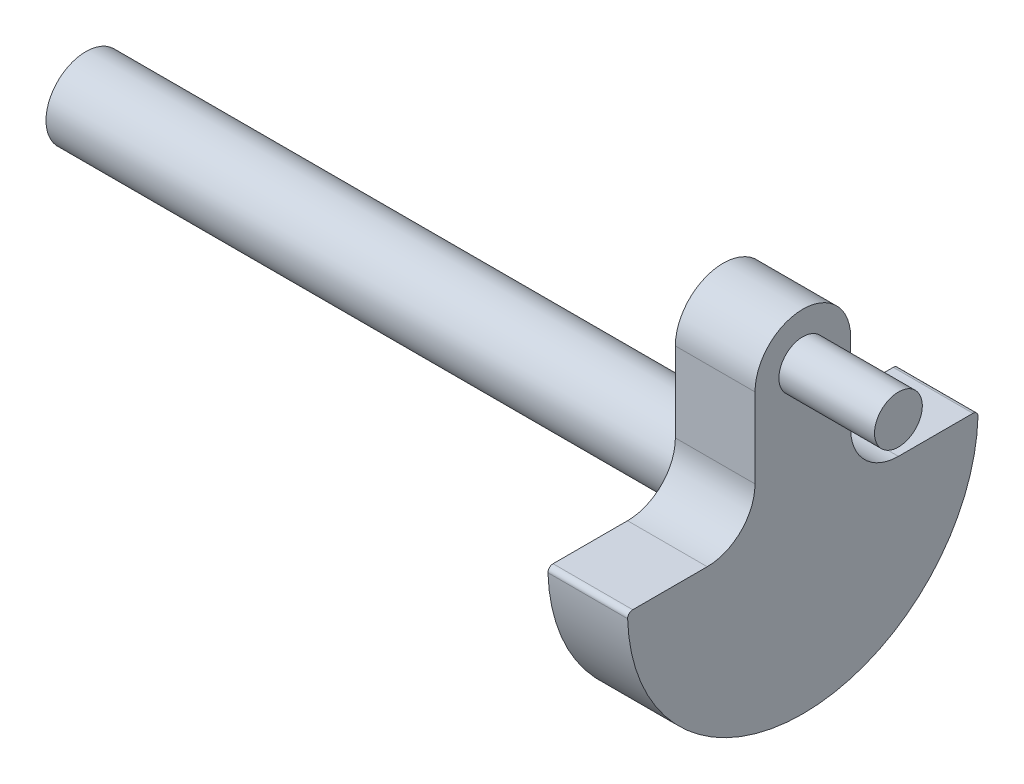
ISO-10303-21;
HEADER;
FILE_DESCRIPTION(('STEP AP214'),'2;1');
FILE_NAME('part.step','',(''),(''),'','','');
FILE_SCHEMA(('AUTOMOTIVE_DESIGN { 1 0 10303 214 1 1 1 1 }'));
ENDSEC;
DATA;
#1=APPLICATION_CONTEXT('core data for automotive mechanical design processes');
#2=APPLICATION_PROTOCOL_DEFINITION('international standard','automotive_design',2000,#1);
#3=PRODUCT_CONTEXT('',#1,'mechanical');
#4=PRODUCT('Part','Part','',(#3));
#5=PRODUCT_RELATED_PRODUCT_CATEGORY('part','',(#4));
#6=PRODUCT_DEFINITION_FORMATION('','',#4);
#7=PRODUCT_DEFINITION_CONTEXT('part definition',#1,'design');
#8=PRODUCT_DEFINITION('design','',#6,#7);
#9=PRODUCT_DEFINITION_SHAPE('','',#8);
#10=(LENGTH_UNIT() NAMED_UNIT(*) SI_UNIT(.MILLI.,.METRE.));
#11=(NAMED_UNIT(*) PLANE_ANGLE_UNIT() SI_UNIT($,.RADIAN.));
#12=(NAMED_UNIT(*) SI_UNIT($,.STERADIAN.) SOLID_ANGLE_UNIT());
#13=UNCERTAINTY_MEASURE_WITH_UNIT(LENGTH_MEASURE(1.E-05),#10,'distance_accuracy_value','');
#14=(GEOMETRIC_REPRESENTATION_CONTEXT(3) GLOBAL_UNCERTAINTY_ASSIGNED_CONTEXT((#13)) GLOBAL_UNIT_ASSIGNED_CONTEXT((#10,
#11,#12)) REPRESENTATION_CONTEXT('',''));
#15=CARTESIAN_POINT('',(0.,0.,0.));
#16=DIRECTION('',(0.,0.,1.));
#17=DIRECTION('',(1.,0.,0.));
#18=AXIS2_PLACEMENT_3D('',#15,#16,#17);
#19=CARTESIAN_POINT('',(3.96875,6.35,0.));
#20=DIRECTION('',(1.,0.,0.));
#21=DIRECTION('',(0.,0.,-1.));
#22=AXIS2_PLACEMENT_3D('',#19,#20,#21);
#23=PLANE('',#22);
#24=CARTESIAN_POINT('',(3.96875,6.35,0.));
#25=DIRECTION('',(1.,0.,0.));
#26=DIRECTION('',(0.,0.,-1.));
#27=AXIS2_PLACEMENT_3D('',#24,#25,#26);
#28=CIRCLE('',#27,1.190625);
#29=CARTESIAN_POINT('',(3.96875,6.35,-1.190625));
#30=VERTEX_POINT('',#29);
#31=EDGE_CURVE('E242',#30,#30,#28,.T.);
#32=ORIENTED_EDGE('',*,*,#31,.F.);
#33=EDGE_LOOP('',(#32));
#34=FACE_BOUND('',#33,.T.);
#35=CARTESIAN_POINT('',(3.96875,0.,0.));
#36=DIRECTION('',(1.,0.,0.));
#37=DIRECTION('',(0.,0.,-1.));
#38=AXIS2_PLACEMENT_3D('',#35,#36,#37);
#39=CIRCLE('',#38,8.73125);
#40=CARTESIAN_POINT('',(3.96875,-0.261610486891387,8.7273298617417));
#41=VERTEX_POINT('',#40);
#42=CARTESIAN_POINT('',(3.96875,-0.261610486891387,-8.7273298617417));
#43=VERTEX_POINT('',#42);
#44=EDGE_CURVE('E209',#41,#43,#39,.T.);
#45=ORIENTED_EDGE('',*,*,#44,.T.);
#46=CARTESIAN_POINT('',(3.96875,-0.254000000000001,-8.4734439021274));
#47=DIRECTION('',(1.,0.,0.));
#48=DIRECTION('',(0.,0.,-1.));
#49=AXIS2_PLACEMENT_3D('',#46,#47,#48);
#50=CIRCLE('',#49,0.254);
#51=CARTESIAN_POINT('',(3.96875,0.,-8.4734439021274));
#52=VERTEX_POINT('',#51);
#53=EDGE_CURVE('E51',#43,#52,#50,.T.);
#54=ORIENTED_EDGE('',*,*,#53,.T.);
#55=DIRECTION('',(0.,0.,1.));
#56=VECTOR('',#55,1.);
#57=CARTESIAN_POINT('',(3.96875,0.,-8.73125));
#58=LINE('',#57,#56);
#59=CARTESIAN_POINT('',(3.96875,0.,-4.76250000000001));
#60=VERTEX_POINT('',#59);
#61=EDGE_CURVE('E208',#52,#60,#58,.T.);
#62=ORIENTED_EDGE('',*,*,#61,.T.);
#63=CARTESIAN_POINT('',(3.96875,2.38125,-4.76250000000001));
#64=DIRECTION('',(1.,0.,0.));
#65=DIRECTION('',(0.,0.,-1.));
#66=AXIS2_PLACEMENT_3D('',#63,#64,#65);
#67=CIRCLE('',#66,2.38125);
#68=CARTESIAN_POINT('',(3.96875,2.38124999999999,-2.38125000000001));
#69=VERTEX_POINT('',#68);
#70=EDGE_CURVE('E178',#60,#69,#67,.F.);
#71=ORIENTED_EDGE('',*,*,#70,.T.);
#72=DIRECTION('',(0.,1.,0.));
#73=VECTOR('',#72,1.);
#74=CARTESIAN_POINT('',(3.96875,6.35,-2.38125));
#75=LINE('',#74,#73);
#76=CARTESIAN_POINT('',(3.96875,6.35,-2.38125));
#77=VERTEX_POINT('',#76);
#78=EDGE_CURVE('E139',#69,#77,#75,.T.);
#79=ORIENTED_EDGE('',*,*,#78,.T.);
#80=CARTESIAN_POINT('',(3.96875,6.35,0.));
#81=DIRECTION('',(1.,0.,0.));
#82=DIRECTION('',(0.,0.,-1.));
#83=AXIS2_PLACEMENT_3D('',#80,#81,#82);
#84=CIRCLE('',#83,2.38125);
#85=CARTESIAN_POINT('',(3.96875,6.35,2.38125));
#86=VERTEX_POINT('',#85);
#87=EDGE_CURVE('E135',#77,#86,#84,.T.);
#88=ORIENTED_EDGE('',*,*,#87,.T.);
#89=DIRECTION('',(0.,-1.,0.));
#90=VECTOR('',#89,1.);
#91=CARTESIAN_POINT('',(3.96875,6.35,2.38125));
#92=LINE('',#91,#90);
#93=CARTESIAN_POINT('',(3.96875,2.38125000000001,2.38124999999999));
#94=VERTEX_POINT('',#93);
#95=EDGE_CURVE('E122',#86,#94,#92,.T.);
#96=ORIENTED_EDGE('',*,*,#95,.T.);
#97=CARTESIAN_POINT('',(3.96875,2.38125,4.76249999999999));
#98=DIRECTION('',(1.,0.,0.));
#99=DIRECTION('',(0.,0.,-1.));
#100=AXIS2_PLACEMENT_3D('',#97,#98,#99);
#101=CIRCLE('',#100,2.38125);
#102=CARTESIAN_POINT('',(3.96875,0.,4.76249999999999));
#103=VERTEX_POINT('',#102);
#104=EDGE_CURVE('E184',#94,#103,#101,.F.);
#105=ORIENTED_EDGE('',*,*,#104,.T.);
#106=DIRECTION('',(0.,0.,1.));
#107=VECTOR('',#106,1.);
#108=CARTESIAN_POINT('',(3.96875,0.,2.38124999999998));
#109=LINE('',#108,#107);
#110=CARTESIAN_POINT('',(3.96875,0.,8.4734439021274));
#111=VERTEX_POINT('',#110);
#112=EDGE_CURVE('E134',#103,#111,#109,.T.);
#113=ORIENTED_EDGE('',*,*,#112,.T.);
#114=CARTESIAN_POINT('',(3.96875,-0.254000000000001,8.4734439021274));
#115=DIRECTION('',(1.,0.,0.));
#116=DIRECTION('',(0.,0.,-1.));
#117=AXIS2_PLACEMENT_3D('',#114,#115,#116);
#118=CIRCLE('',#117,0.254);
#119=EDGE_CURVE('E203',#111,#41,#118,.T.);
#120=ORIENTED_EDGE('',*,*,#119,.T.);
#121=EDGE_LOOP('',(#45,#54,#62,#71,#79,#88,#96,#105,#113,#120));
#122=FACE_BOUND('',#121,.T.);
#123=ADVANCED_FACE('F42',(#34,#122),#23,.T.);
#124=CARTESIAN_POINT('',(0.,6.35,0.));
#125=DIRECTION('',(1.,0.,0.));
#126=DIRECTION('',(0.,0.,-1.));
#127=AXIS2_PLACEMENT_3D('',#124,#125,#126);
#128=PLANE('',#127);
#129=CARTESIAN_POINT('',(0.,0.,0.));
#130=DIRECTION('',(-1.,0.,0.));
#131=DIRECTION('',(0.,0.,1.));
#132=AXIS2_PLACEMENT_3D('',#129,#130,#131);
#133=CIRCLE('',#132,1.984375);
#134=CARTESIAN_POINT('',(0.,0.,1.984375));
#135=VERTEX_POINT('',#134);
#136=EDGE_CURVE('E150',#135,#135,#133,.T.);
#137=ORIENTED_EDGE('',*,*,#136,.F.);
#138=EDGE_LOOP('',(#137));
#139=FACE_BOUND('',#138,.T.);
#140=DIRECTION('',(0.,0.,1.));
#141=VECTOR('',#140,1.);
#142=CARTESIAN_POINT('',(0.,0.,-8.73125));
#143=LINE('',#142,#141);
#144=CARTESIAN_POINT('',(0.,0.,-8.4734439021274));
#145=VERTEX_POINT('',#144);
#146=CARTESIAN_POINT('',(0.,0.,-4.76250000000001));
#147=VERTEX_POINT('',#146);
#148=EDGE_CURVE('E224',#145,#147,#143,.T.);
#149=ORIENTED_EDGE('',*,*,#148,.F.);
#150=CARTESIAN_POINT('',(0.,-0.254000000000001,-8.4734439021274));
#151=DIRECTION('',(1.,0.,0.));
#152=DIRECTION('',(0.,0.,-1.));
#153=AXIS2_PLACEMENT_3D('',#150,#151,#152);
#154=CIRCLE('',#153,0.254);
#155=CARTESIAN_POINT('',(0.,-0.261610486891387,-8.7273298617417));
#156=VERTEX_POINT('',#155);
#157=EDGE_CURVE('E194',#145,#156,#154,.F.);
#158=ORIENTED_EDGE('',*,*,#157,.T.);
#159=CARTESIAN_POINT('',(0.,0.,0.));
#160=DIRECTION('',(1.,0.,0.));
#161=DIRECTION('',(0.,0.,-1.));
#162=AXIS2_PLACEMENT_3D('',#159,#160,#161);
#163=CIRCLE('',#162,8.73125);
#164=CARTESIAN_POINT('',(0.,-0.261610486891387,8.7273298617417));
#165=VERTEX_POINT('',#164);
#166=EDGE_CURVE('E223',#165,#156,#163,.T.);
#167=ORIENTED_EDGE('',*,*,#166,.F.);
#168=CARTESIAN_POINT('',(0.,-0.254000000000001,8.4734439021274));
#169=DIRECTION('',(1.,0.,0.));
#170=DIRECTION('',(0.,0.,-1.));
#171=AXIS2_PLACEMENT_3D('',#168,#169,#170);
#172=CIRCLE('',#171,0.254);
#173=CARTESIAN_POINT('',(0.,0.,8.4734439021274));
#174=VERTEX_POINT('',#173);
#175=EDGE_CURVE('E191',#165,#174,#172,.F.);
#176=ORIENTED_EDGE('',*,*,#175,.T.);
#177=DIRECTION('',(0.,0.,1.));
#178=VECTOR('',#177,1.);
#179=CARTESIAN_POINT('',(0.,0.,2.38124999999998));
#180=LINE('',#179,#178);
#181=CARTESIAN_POINT('',(0.,0.,4.76249999999999));
#182=VERTEX_POINT('',#181);
#183=EDGE_CURVE('E228',#182,#174,#180,.T.);
#184=ORIENTED_EDGE('',*,*,#183,.F.);
#185=CARTESIAN_POINT('',(0.,2.38125,4.76249999999999));
#186=DIRECTION('',(1.,0.,0.));
#187=DIRECTION('',(0.,0.,-1.));
#188=AXIS2_PLACEMENT_3D('',#185,#186,#187);
#189=CIRCLE('',#188,2.38125);
#190=CARTESIAN_POINT('',(0.,2.38125000000001,2.38124999999999));
#191=VERTEX_POINT('',#190);
#192=EDGE_CURVE('E181',#182,#191,#189,.T.);
#193=ORIENTED_EDGE('',*,*,#192,.T.);
#194=DIRECTION('',(0.,-1.,0.));
#195=VECTOR('',#194,1.);
#196=CARTESIAN_POINT('',(0.,6.35,2.38125));
#197=LINE('',#196,#195);
#198=CARTESIAN_POINT('',(0.,6.35,2.38125));
#199=VERTEX_POINT('',#198);
#200=EDGE_CURVE('E233',#199,#191,#197,.T.);
#201=ORIENTED_EDGE('',*,*,#200,.F.);
#202=CARTESIAN_POINT('',(0.,6.35,0.));
#203=DIRECTION('',(1.,0.,0.));
#204=DIRECTION('',(0.,0.,-1.));
#205=AXIS2_PLACEMENT_3D('',#202,#203,#204);
#206=CIRCLE('',#205,2.38125);
#207=CARTESIAN_POINT('',(0.,6.35,-2.38125));
#208=VERTEX_POINT('',#207);
#209=EDGE_CURVE('E148',#208,#199,#206,.T.);
#210=ORIENTED_EDGE('',*,*,#209,.F.);
#211=DIRECTION('',(0.,1.,0.));
#212=VECTOR('',#211,1.);
#213=CARTESIAN_POINT('',(0.,6.35,-2.38125));
#214=LINE('',#213,#212);
#215=CARTESIAN_POINT('',(0.,2.38124999999999,-2.38125000000001));
#216=VERTEX_POINT('',#215);
#217=EDGE_CURVE('E144',#216,#208,#214,.T.);
#218=ORIENTED_EDGE('',*,*,#217,.F.);
#219=CARTESIAN_POINT('',(0.,2.38125,-4.76250000000001));
#220=DIRECTION('',(1.,0.,0.));
#221=DIRECTION('',(0.,0.,-1.));
#222=AXIS2_PLACEMENT_3D('',#219,#220,#221);
#223=CIRCLE('',#222,2.38125);
#224=EDGE_CURVE('E174',#216,#147,#223,.T.);
#225=ORIENTED_EDGE('',*,*,#224,.T.);
#226=EDGE_LOOP('',(#149,#158,#167,#176,#184,#193,#201,#210,#218,#225));
#227=FACE_BOUND('',#226,.T.);
#228=ADVANCED_FACE('F222',(#139,#227),#128,.F.);
#229=CARTESIAN_POINT('',(3.96875,6.35,0.));
#230=DIRECTION('',(-1.,0.,0.));
#231=DIRECTION('',(0.,0.,1.));
#232=AXIS2_PLACEMENT_3D('',#229,#230,#231);
#233=CYLINDRICAL_SURFACE('',#232,2.38125);
#234=ORIENTED_EDGE('',*,*,#209,.T.);
#235=DIRECTION('',(-1.,0.,0.));
#236=VECTOR('',#235,1.);
#237=CARTESIAN_POINT('',(3.96875,6.35,2.38125));
#238=LINE('',#237,#236);
#239=EDGE_CURVE('E127',#86,#199,#238,.T.);
#240=ORIENTED_EDGE('',*,*,#239,.F.);
#241=ORIENTED_EDGE('',*,*,#87,.F.);
#242=DIRECTION('',(-1.,0.,0.));
#243=VECTOR('',#242,1.);
#244=CARTESIAN_POINT('',(3.96875,6.35,-2.38125));
#245=LINE('',#244,#243);
#246=EDGE_CURVE('E151',#77,#208,#245,.T.);
#247=ORIENTED_EDGE('',*,*,#246,.T.);
#248=EDGE_LOOP('',(#234,#240,#241,#247));
#249=FACE_BOUND('',#248,.T.);
#250=ADVANCED_FACE('F146',(#249),#233,.T.);
#251=CARTESIAN_POINT('',(3.96875,6.35,2.38125));
#252=DIRECTION('',(0.,0.,-1.));
#253=DIRECTION('',(0.,1.,0.));
#254=AXIS2_PLACEMENT_3D('',#251,#252,#253);
#255=PLANE('',#254);
#256=ORIENTED_EDGE('',*,*,#200,.T.);
#257=DIRECTION('',(-1.,0.,0.));
#258=VECTOR('',#257,1.);
#259=CARTESIAN_POINT('',(3.96875,2.38125000000001,2.38124999999999));
#260=LINE('',#259,#258);
#261=EDGE_CURVE('E130',#191,#94,#260,.F.);
#262=ORIENTED_EDGE('',*,*,#261,.T.);
#263=ORIENTED_EDGE('',*,*,#95,.F.);
#264=ORIENTED_EDGE('',*,*,#239,.T.);
#265=EDGE_LOOP('',(#256,#262,#263,#264));
#266=FACE_BOUND('',#265,.T.);
#267=ADVANCED_FACE('F125',(#266),#255,.F.);
#268=CARTESIAN_POINT('',(3.96875,0.,2.38124999999998));
#269=DIRECTION('',(0.,-1.,0.));
#270=DIRECTION('',(0.,0.,-1.));
#271=AXIS2_PLACEMENT_3D('',#268,#269,#270);
#272=PLANE('',#271);
#273=ORIENTED_EDGE('',*,*,#183,.T.);
#274=DIRECTION('',(-1.,0.,0.));
#275=VECTOR('',#274,1.);
#276=CARTESIAN_POINT('',(3.96875,0.,8.4734439021274));
#277=LINE('',#276,#275);
#278=EDGE_CURVE('E11',#174,#111,#277,.F.);
#279=ORIENTED_EDGE('',*,*,#278,.T.);
#280=ORIENTED_EDGE('',*,*,#112,.F.);
#281=DIRECTION('',(-1.,0.,0.));
#282=VECTOR('',#281,1.);
#283=CARTESIAN_POINT('',(0.,0.,4.76249999999999));
#284=LINE('',#283,#282);
#285=EDGE_CURVE('E168',#103,#182,#284,.T.);
#286=ORIENTED_EDGE('',*,*,#285,.T.);
#287=EDGE_LOOP('',(#273,#279,#280,#286));
#288=FACE_BOUND('',#287,.T.);
#289=ADVANCED_FACE('F291',(#288),#272,.F.);
#290=CARTESIAN_POINT('',(3.96875,0.,0.));
#291=DIRECTION('',(-1.,0.,0.));
#292=DIRECTION('',(0.,0.,1.));
#293=AXIS2_PLACEMENT_3D('',#290,#291,#292);
#294=CYLINDRICAL_SURFACE('',#293,8.73125);
#295=ORIENTED_EDGE('',*,*,#166,.T.);
#296=DIRECTION('',(-1.,0.,0.));
#297=VECTOR('',#296,1.);
#298=CARTESIAN_POINT('',(3.96875,-0.261610486891387,-8.7273298617417));
#299=LINE('',#298,#297);
#300=EDGE_CURVE('E64',#156,#43,#299,.F.);
#301=ORIENTED_EDGE('',*,*,#300,.T.);
#302=ORIENTED_EDGE('',*,*,#44,.F.);
#303=DIRECTION('',(-1.,0.,0.));
#304=VECTOR('',#303,1.);
#305=CARTESIAN_POINT('',(3.96875,-0.261610486891387,8.7273298617417));
#306=LINE('',#305,#304);
#307=EDGE_CURVE('E197',#41,#165,#306,.T.);
#308=ORIENTED_EDGE('',*,*,#307,.T.);
#309=EDGE_LOOP('',(#295,#301,#302,#308));
#310=FACE_BOUND('',#309,.T.);
#311=ADVANCED_FACE('F225',(#310),#294,.T.);
#312=CARTESIAN_POINT('',(3.96875,0.,-8.73125));
#313=DIRECTION('',(0.,-1.,0.));
#314=DIRECTION('',(0.,0.,-1.));
#315=AXIS2_PLACEMENT_3D('',#312,#313,#314);
#316=PLANE('',#315);
#317=ORIENTED_EDGE('',*,*,#61,.F.);
#318=DIRECTION('',(-1.,0.,0.));
#319=VECTOR('',#318,1.);
#320=CARTESIAN_POINT('',(3.96875,0.,-8.4734439021274));
#321=LINE('',#320,#319);
#322=EDGE_CURVE('E187',#52,#145,#321,.T.);
#323=ORIENTED_EDGE('',*,*,#322,.T.);
#324=ORIENTED_EDGE('',*,*,#148,.T.);
#325=DIRECTION('',(-1.,0.,0.));
#326=VECTOR('',#325,1.);
#327=CARTESIAN_POINT('',(3.96875,0.,-4.76250000000001));
#328=LINE('',#327,#326);
#329=EDGE_CURVE('E164',#147,#60,#328,.F.);
#330=ORIENTED_EDGE('',*,*,#329,.T.);
#331=EDGE_LOOP('',(#317,#323,#324,#330));
#332=FACE_BOUND('',#331,.T.);
#333=ADVANCED_FACE('F213',(#332),#316,.F.);
#334=CARTESIAN_POINT('',(3.96875,6.35,-2.38125));
#335=DIRECTION('',(0.,0.,1.));
#336=DIRECTION('',(0.,-1.,0.));
#337=AXIS2_PLACEMENT_3D('',#334,#335,#336);
#338=PLANE('',#337);
#339=ORIENTED_EDGE('',*,*,#78,.F.);
#340=DIRECTION('',(-1.,0.,0.));
#341=VECTOR('',#340,1.);
#342=CARTESIAN_POINT('',(0.,2.38124999999999,-2.38125000000001));
#343=LINE('',#342,#341);
#344=EDGE_CURVE('E156',#69,#216,#343,.T.);
#345=ORIENTED_EDGE('',*,*,#344,.T.);
#346=ORIENTED_EDGE('',*,*,#217,.T.);
#347=ORIENTED_EDGE('',*,*,#246,.F.);
#348=EDGE_LOOP('',(#339,#345,#346,#347));
#349=FACE_BOUND('',#348,.T.);
#350=ADVANCED_FACE('F239',(#349),#338,.F.);
#351=CARTESIAN_POINT('',(8.73125,6.35,0.));
#352=DIRECTION('',(-1.,0.,0.));
#353=DIRECTION('',(0.,0.,1.));
#354=AXIS2_PLACEMENT_3D('',#351,#352,#353);
#355=CYLINDRICAL_SURFACE('',#354,1.190625);
#356=ORIENTED_EDGE('',*,*,#31,.T.);
#357=EDGE_LOOP('',(#356));
#358=FACE_BOUND('',#357,.T.);
#359=CARTESIAN_POINT('',(8.73125,6.35,0.));
#360=DIRECTION('',(-1.,0.,0.));
#361=DIRECTION('',(0.,0.,1.));
#362=AXIS2_PLACEMENT_3D('',#359,#360,#361);
#363=CIRCLE('',#362,1.190625);
#364=CARTESIAN_POINT('',(8.73125,6.35,1.190625));
#365=VERTEX_POINT('',#364);
#366=EDGE_CURVE('E247',#365,#365,#363,.T.);
#367=ORIENTED_EDGE('',*,*,#366,.T.);
#368=EDGE_LOOP('',(#367));
#369=FACE_BOUND('',#368,.T.);
#370=ADVANCED_FACE('F286',(#358,#369),#355,.T.);
#371=CARTESIAN_POINT('',(8.73125,6.35,0.));
#372=DIRECTION('',(-1.,0.,0.));
#373=DIRECTION('',(0.,0.,1.));
#374=AXIS2_PLACEMENT_3D('',#371,#372,#373);
#375=PLANE('',#374);
#376=ORIENTED_EDGE('',*,*,#366,.F.);
#377=EDGE_LOOP('',(#376));
#378=FACE_BOUND('',#377,.T.);
#379=ADVANCED_FACE('F269',(#378),#375,.F.);
#380=CARTESIAN_POINT('',(-31.75,0.,0.));
#381=DIRECTION('',(1.,0.,0.));
#382=DIRECTION('',(0.,0.,-1.));
#383=AXIS2_PLACEMENT_3D('',#380,#381,#382);
#384=CYLINDRICAL_SURFACE('',#383,1.984375);
#385=CARTESIAN_POINT('',(-31.75,0.,0.));
#386=DIRECTION('',(-1.,0.,0.));
#387=DIRECTION('',(0.,0.,1.));
#388=AXIS2_PLACEMENT_3D('',#385,#386,#387);
#389=CIRCLE('',#388,1.984375);
#390=CARTESIAN_POINT('',(-31.75,0.,1.984375));
#391=VERTEX_POINT('',#390);
#392=EDGE_CURVE('E258',#391,#391,#389,.T.);
#393=ORIENTED_EDGE('',*,*,#392,.F.);
#394=EDGE_LOOP('',(#393));
#395=FACE_BOUND('',#394,.T.);
#396=ORIENTED_EDGE('',*,*,#136,.T.);
#397=EDGE_LOOP('',(#396));
#398=FACE_BOUND('',#397,.T.);
#399=ADVANCED_FACE('F266',(#395,#398),#384,.T.);
#400=CARTESIAN_POINT('',(-31.75,0.,0.));
#401=DIRECTION('',(-1.,0.,0.));
#402=DIRECTION('',(0.,0.,1.));
#403=AXIS2_PLACEMENT_3D('',#400,#401,#402);
#404=PLANE('',#403);
#405=ORIENTED_EDGE('',*,*,#392,.T.);
#406=EDGE_LOOP('',(#405));
#407=FACE_BOUND('',#406,.T.);
#408=ADVANCED_FACE('F264',(#407),#404,.T.);
#409=CARTESIAN_POINT('',(3.96875,2.38125,-4.76250000000001));
#410=DIRECTION('',(1.,0.,0.));
#411=DIRECTION('',(0.,0.,-1.));
#412=AXIS2_PLACEMENT_3D('',#409,#410,#411);
#413=CYLINDRICAL_SURFACE('',#412,2.38125);
#414=ORIENTED_EDGE('',*,*,#70,.F.);
#415=ORIENTED_EDGE('',*,*,#329,.F.);
#416=ORIENTED_EDGE('',*,*,#224,.F.);
#417=ORIENTED_EDGE('',*,*,#344,.F.);
#418=EDGE_LOOP('',(#414,#415,#416,#417));
#419=FACE_BOUND('',#418,.T.);
#420=ADVANCED_FACE('F296',(#419),#413,.F.);
#421=CARTESIAN_POINT('',(3.96875,2.38125,4.76249999999999));
#422=DIRECTION('',(1.,0.,0.));
#423=DIRECTION('',(0.,0.,-1.));
#424=AXIS2_PLACEMENT_3D('',#421,#422,#423);
#425=CYLINDRICAL_SURFACE('',#424,2.38125);
#426=ORIENTED_EDGE('',*,*,#104,.F.);
#427=ORIENTED_EDGE('',*,*,#261,.F.);
#428=ORIENTED_EDGE('',*,*,#192,.F.);
#429=ORIENTED_EDGE('',*,*,#285,.F.);
#430=EDGE_LOOP('',(#426,#427,#428,#429));
#431=FACE_BOUND('',#430,.T.);
#432=ADVANCED_FACE('F299',(#431),#425,.F.);
#433=CARTESIAN_POINT('',(3.96875,-0.254000000000001,-8.4734439021274));
#434=DIRECTION('',(-1.,0.,0.));
#435=DIRECTION('',(0.,0.,1.));
#436=AXIS2_PLACEMENT_3D('',#433,#434,#435);
#437=CYLINDRICAL_SURFACE('',#436,0.254);
#438=ORIENTED_EDGE('',*,*,#53,.F.);
#439=ORIENTED_EDGE('',*,*,#300,.F.);
#440=ORIENTED_EDGE('',*,*,#157,.F.);
#441=ORIENTED_EDGE('',*,*,#322,.F.);
#442=EDGE_LOOP('',(#438,#439,#440,#441));
#443=FACE_BOUND('',#442,.T.);
#444=ADVANCED_FACE('F219',(#443),#437,.T.);
#445=CARTESIAN_POINT('',(3.96875,-0.254000000000001,8.4734439021274));
#446=DIRECTION('',(-1.,0.,0.));
#447=DIRECTION('',(0.,0.,1.));
#448=AXIS2_PLACEMENT_3D('',#445,#446,#447);
#449=CYLINDRICAL_SURFACE('',#448,0.254);
#450=ORIENTED_EDGE('',*,*,#119,.F.);
#451=ORIENTED_EDGE('',*,*,#278,.F.);
#452=ORIENTED_EDGE('',*,*,#175,.F.);
#453=ORIENTED_EDGE('',*,*,#307,.F.);
#454=EDGE_LOOP('',(#450,#451,#452,#453));
#455=FACE_BOUND('',#454,.T.);
#456=ADVANCED_FACE('F44',(#455),#449,.T.);
#457=CLOSED_SHELL('',(#123,#228,#250,#267,#289,#311,#333,#350,#370,#379,#399,#408,#420,#432,
#444,#456));
#458=MANIFOLD_SOLID_BREP('B2',#457);
#459=ADVANCED_BREP_SHAPE_REPRESENTATION('',(#18,#458),#14);
#460=SHAPE_DEFINITION_REPRESENTATION(#9,#459);
ENDSEC;
END-ISO-10303-21;
